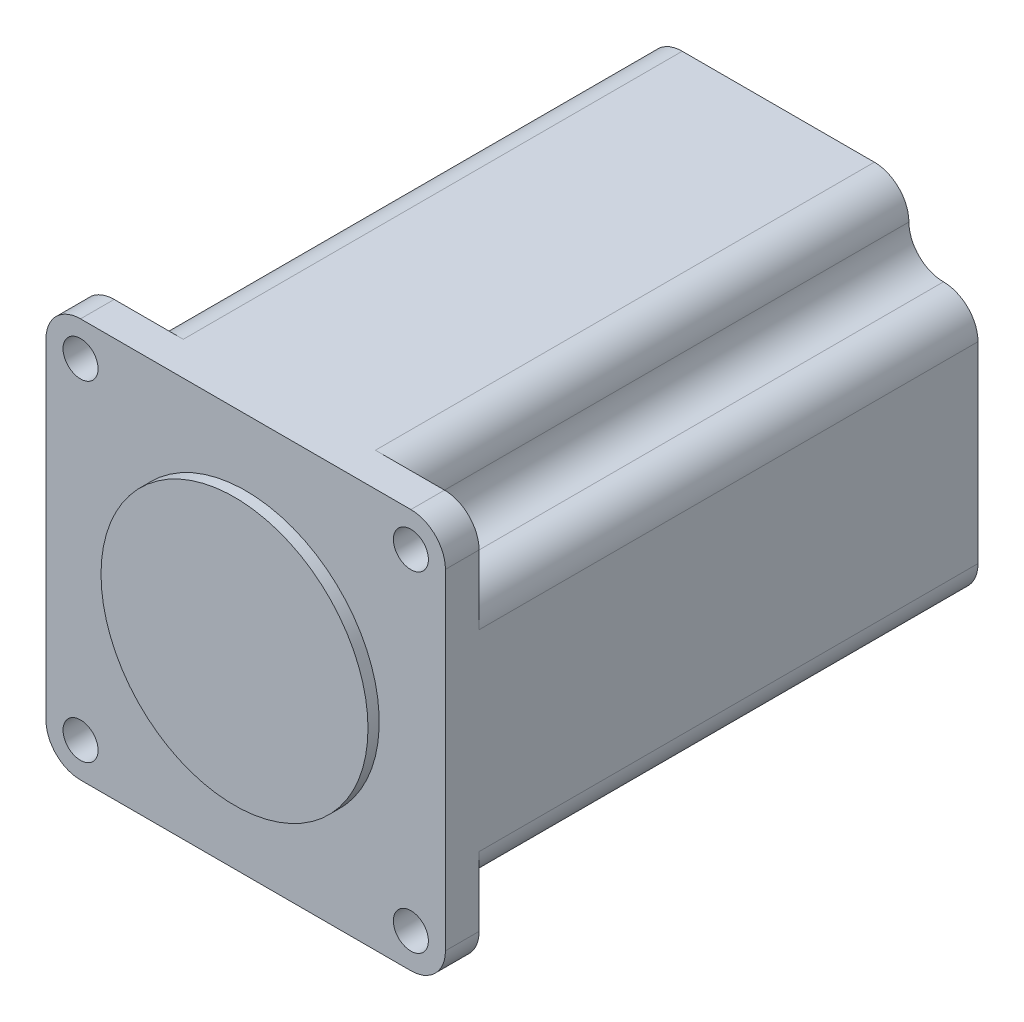
ISO-10303-21;
HEADER;
FILE_DESCRIPTION(('STEP AP214'),'2;1');
FILE_NAME('part.step','',(''),(''),'','','');
FILE_SCHEMA(('AUTOMOTIVE_DESIGN { 1 0 10303 214 1 1 1 1 }'));
ENDSEC;
DATA;
#1=APPLICATION_CONTEXT('core data for automotive mechanical design processes');
#2=APPLICATION_PROTOCOL_DEFINITION('international standard','automotive_design',2000,#1);
#3=PRODUCT_CONTEXT('',#1,'mechanical');
#4=PRODUCT('Part','Part','',(#3));
#5=PRODUCT_RELATED_PRODUCT_CATEGORY('part','',(#4));
#6=PRODUCT_DEFINITION_FORMATION('','',#4);
#7=PRODUCT_DEFINITION_CONTEXT('part definition',#1,'design');
#8=PRODUCT_DEFINITION('design','',#6,#7);
#9=PRODUCT_DEFINITION_SHAPE('','',#8);
#10=(LENGTH_UNIT() NAMED_UNIT(*) SI_UNIT(.MILLI.,.METRE.));
#11=(NAMED_UNIT(*) PLANE_ANGLE_UNIT() SI_UNIT($,.RADIAN.));
#12=(NAMED_UNIT(*) SI_UNIT($,.STERADIAN.) SOLID_ANGLE_UNIT());
#13=UNCERTAINTY_MEASURE_WITH_UNIT(LENGTH_MEASURE(1.E-05),#10,'distance_accuracy_value','');
#14=(GEOMETRIC_REPRESENTATION_CONTEXT(3) GLOBAL_UNCERTAINTY_ASSIGNED_CONTEXT((#13)) GLOBAL_UNIT_ASSIGNED_CONTEXT((#10,
#11,#12)) REPRESENTATION_CONTEXT('',''));
#15=CARTESIAN_POINT('',(0.,0.,0.));
#16=DIRECTION('',(0.,0.,1.));
#17=DIRECTION('',(1.,0.,0.));
#18=AXIS2_PLACEMENT_3D('',#15,#16,#17);
#19=CARTESIAN_POINT('',(0.,0.,0.));
#20=DIRECTION('',(0.,0.,-1.));
#21=DIRECTION('',(-1.,0.,0.));
#22=AXIS2_PLACEMENT_3D('',#19,#20,#21);
#23=PLANE('',#22);
#24=DIRECTION('',(0.,-1.,0.));
#25=VECTOR('',#24,1.);
#26=CARTESIAN_POINT('',(-28.5,-28.5,0.));
#27=LINE('',#26,#25);
#28=CARTESIAN_POINT('',(-28.5,23.57,0.));
#29=VERTEX_POINT('',#28);
#30=CARTESIAN_POINT('',(-28.5,-23.57,0.));
#31=VERTEX_POINT('',#30);
#32=EDGE_CURVE('E240',#29,#31,#27,.T.);
#33=ORIENTED_EDGE('',*,*,#32,.T.);
#34=CARTESIAN_POINT('',(-23.57,-23.57,0.));
#35=DIRECTION('',(0.,0.,1.));
#36=DIRECTION('',(-1.,0.,0.));
#37=AXIS2_PLACEMENT_3D('',#34,#35,#36);
#38=CIRCLE('',#37,4.93);
#39=CARTESIAN_POINT('',(-23.57,-28.5,0.));
#40=VERTEX_POINT('',#39);
#41=EDGE_CURVE('E265',#31,#40,#38,.T.);
#42=ORIENTED_EDGE('',*,*,#41,.T.);
#43=DIRECTION('',(1.,0.,0.));
#44=VECTOR('',#43,1.);
#45=CARTESIAN_POINT('',(-28.5,-28.5,0.));
#46=LINE('',#45,#44);
#47=CARTESIAN_POINT('',(23.57,-28.5,0.));
#48=VERTEX_POINT('',#47);
#49=EDGE_CURVE('E243',#40,#48,#46,.T.);
#50=ORIENTED_EDGE('',*,*,#49,.T.);
#51=CARTESIAN_POINT('',(23.57,-23.57,0.));
#52=DIRECTION('',(0.,0.,1.));
#53=DIRECTION('',(-1.,0.,0.));
#54=AXIS2_PLACEMENT_3D('',#51,#52,#53);
#55=CIRCLE('',#54,4.93);
#56=CARTESIAN_POINT('',(28.5,-23.57,0.));
#57=VERTEX_POINT('',#56);
#58=EDGE_CURVE('E266',#48,#57,#55,.T.);
#59=ORIENTED_EDGE('',*,*,#58,.T.);
#60=DIRECTION('',(0.,1.,0.));
#61=VECTOR('',#60,1.);
#62=CARTESIAN_POINT('',(28.5,-28.5,0.));
#63=LINE('',#62,#61);
#64=CARTESIAN_POINT('',(28.5,23.57,0.));
#65=VERTEX_POINT('',#64);
#66=EDGE_CURVE('E234',#57,#65,#63,.T.);
#67=ORIENTED_EDGE('',*,*,#66,.T.);
#68=CARTESIAN_POINT('',(23.57,23.57,0.));
#69=DIRECTION('',(0.,0.,1.));
#70=DIRECTION('',(-1.,0.,0.));
#71=AXIS2_PLACEMENT_3D('',#68,#69,#70);
#72=CIRCLE('',#71,4.93);
#73=CARTESIAN_POINT('',(23.57,28.5,0.));
#74=VERTEX_POINT('',#73);
#75=EDGE_CURVE('E288',#65,#74,#72,.T.);
#76=ORIENTED_EDGE('',*,*,#75,.T.);
#77=DIRECTION('',(-1.,0.,0.));
#78=VECTOR('',#77,1.);
#79=CARTESIAN_POINT('',(-28.5,28.5,0.));
#80=LINE('',#79,#78);
#81=CARTESIAN_POINT('',(-23.57,28.5,0.));
#82=VERTEX_POINT('',#81);
#83=EDGE_CURVE('E236',#74,#82,#80,.T.);
#84=ORIENTED_EDGE('',*,*,#83,.T.);
#85=CARTESIAN_POINT('',(-23.57,23.57,0.));
#86=DIRECTION('',(0.,0.,1.));
#87=DIRECTION('',(-1.,0.,0.));
#88=AXIS2_PLACEMENT_3D('',#85,#86,#87);
#89=CIRCLE('',#88,4.93);
#90=EDGE_CURVE('E279',#82,#29,#89,.T.);
#91=ORIENTED_EDGE('',*,*,#90,.T.);
#92=EDGE_LOOP('',(#33,#42,#50,#59,#67,#76,#84,#91));
#93=FACE_BOUND('',#92,.T.);
#94=CARTESIAN_POINT('',(23.57,23.57,0.));
#95=DIRECTION('',(0.,0.,-1.));
#96=DIRECTION('',(-1.,0.,0.));
#97=AXIS2_PLACEMENT_3D('',#94,#95,#96);
#98=CIRCLE('',#97,2.5);
#99=CARTESIAN_POINT('',(21.07,23.57,0.));
#100=VERTEX_POINT('',#99);
#101=EDGE_CURVE('E237',#100,#100,#98,.T.);
#102=ORIENTED_EDGE('',*,*,#101,.T.);
#103=EDGE_LOOP('',(#102));
#104=FACE_BOUND('',#103,.T.);
#105=CARTESIAN_POINT('',(23.57,-23.57,0.));
#106=DIRECTION('',(0.,0.,-1.));
#107=DIRECTION('',(-1.,0.,0.));
#108=AXIS2_PLACEMENT_3D('',#105,#106,#107);
#109=CIRCLE('',#108,2.5);
#110=CARTESIAN_POINT('',(21.07,-23.57,0.));
#111=VERTEX_POINT('',#110);
#112=EDGE_CURVE('E304',#111,#111,#109,.T.);
#113=ORIENTED_EDGE('',*,*,#112,.T.);
#114=EDGE_LOOP('',(#113));
#115=FACE_BOUND('',#114,.T.);
#116=CARTESIAN_POINT('',(-23.57,23.57,0.));
#117=DIRECTION('',(0.,0.,-1.));
#118=DIRECTION('',(-1.,0.,0.));
#119=AXIS2_PLACEMENT_3D('',#116,#117,#118);
#120=CIRCLE('',#119,2.5);
#121=CARTESIAN_POINT('',(-26.07,23.57,0.));
#122=VERTEX_POINT('',#121);
#123=EDGE_CURVE('E301',#122,#122,#120,.T.);
#124=ORIENTED_EDGE('',*,*,#123,.T.);
#125=EDGE_LOOP('',(#124));
#126=FACE_BOUND('',#125,.T.);
#127=CARTESIAN_POINT('',(-23.57,-23.57,0.));
#128=DIRECTION('',(0.,0.,-1.));
#129=DIRECTION('',(-1.,0.,0.));
#130=AXIS2_PLACEMENT_3D('',#127,#128,#129);
#131=CIRCLE('',#130,2.5);
#132=CARTESIAN_POINT('',(-26.07,-23.57,0.));
#133=VERTEX_POINT('',#132);
#134=EDGE_CURVE('E296',#133,#133,#131,.T.);
#135=ORIENTED_EDGE('',*,*,#134,.T.);
#136=EDGE_LOOP('',(#135));
#137=FACE_BOUND('',#136,.T.);
#138=CARTESIAN_POINT('',(0.,0.,0.));
#139=DIRECTION('',(0.,0.,-1.));
#140=DIRECTION('',(-1.,0.,0.));
#141=AXIS2_PLACEMENT_3D('',#138,#139,#140);
#142=CIRCLE('',#141,19.05);
#143=CARTESIAN_POINT('',(-19.05,0.,0.));
#144=VERTEX_POINT('',#143);
#145=EDGE_CURVE('E13',#144,#144,#142,.F.);
#146=ORIENTED_EDGE('',*,*,#145,.F.);
#147=EDGE_LOOP('',(#146));
#148=FACE_BOUND('',#147,.T.);
#149=ADVANCED_FACE('F37',(#93,#104,#115,#126,#137,#148),#23,.F.);
#150=CARTESIAN_POINT('',(-28.5,-28.5,-76.));
#151=DIRECTION('',(-1.,0.,0.));
#152=DIRECTION('',(0.,0.,1.));
#153=AXIS2_PLACEMENT_3D('',#150,#151,#152);
#154=PLANE('',#153);
#155=DIRECTION('',(0.,0.,-1.));
#156=VECTOR('',#155,1.);
#157=CARTESIAN_POINT('',(-28.5,23.57,0.));
#158=LINE('',#157,#156);
#159=CARTESIAN_POINT('',(-28.5,23.57,-4.8));
#160=VERTEX_POINT('',#159);
#161=EDGE_CURVE('E284',#29,#160,#158,.T.);
#162=ORIENTED_EDGE('',*,*,#161,.T.);
#163=DIRECTION('',(0.,-1.,0.));
#164=VECTOR('',#163,1.);
#165=CARTESIAN_POINT('',(-28.5,-28.5,-4.8));
#166=LINE('',#165,#164);
#167=CARTESIAN_POINT('',(-28.5,13.71,-4.8));
#168=VERTEX_POINT('',#167);
#169=EDGE_CURVE('E60',#160,#168,#166,.T.);
#170=ORIENTED_EDGE('',*,*,#169,.T.);
#171=DIRECTION('',(0.,0.,-1.));
#172=VECTOR('',#171,1.);
#173=CARTESIAN_POINT('',(-28.5,13.71,85.205945086086));
#174=LINE('',#173,#172);
#175=CARTESIAN_POINT('',(-28.5,13.71,-76.));
#176=VERTEX_POINT('',#175);
#177=EDGE_CURVE('E202',#168,#176,#174,.T.);
#178=ORIENTED_EDGE('',*,*,#177,.T.);
#179=DIRECTION('',(0.,-1.,0.));
#180=VECTOR('',#179,1.);
#181=CARTESIAN_POINT('',(-28.5,-28.5,-76.));
#182=LINE('',#181,#180);
#183=CARTESIAN_POINT('',(-28.5,-13.7099999999999,-76.));
#184=VERTEX_POINT('',#183);
#185=EDGE_CURVE('E217',#176,#184,#182,.T.);
#186=ORIENTED_EDGE('',*,*,#185,.T.);
#187=DIRECTION('',(0.,0.,-1.));
#188=VECTOR('',#187,1.);
#189=CARTESIAN_POINT('',(-28.5,-13.7099999999999,85.205945086086));
#190=LINE('',#189,#188);
#191=CARTESIAN_POINT('',(-28.5,-13.7099999999999,-4.8));
#192=VERTEX_POINT('',#191);
#193=EDGE_CURVE('E218',#192,#184,#190,.T.);
#194=ORIENTED_EDGE('',*,*,#193,.F.);
#195=CARTESIAN_POINT('',(-28.5,-23.57,-4.8));
#196=VERTEX_POINT('',#195);
#197=EDGE_CURVE('E250',#192,#196,#166,.T.);
#198=ORIENTED_EDGE('',*,*,#197,.T.);
#199=DIRECTION('',(0.,0.,-1.));
#200=VECTOR('',#199,1.);
#201=CARTESIAN_POINT('',(-28.5,-23.57,0.));
#202=LINE('',#201,#200);
#203=EDGE_CURVE('E260',#31,#196,#202,.T.);
#204=ORIENTED_EDGE('',*,*,#203,.F.);
#205=ORIENTED_EDGE('',*,*,#32,.F.);
#206=EDGE_LOOP('',(#162,#170,#178,#186,#194,#198,#204,#205));
#207=FACE_BOUND('',#206,.T.);
#208=ADVANCED_FACE('F215',(#207),#154,.T.);
#209=CARTESIAN_POINT('',(-28.5,-28.5,-76.));
#210=DIRECTION('',(0.,-1.,0.));
#211=DIRECTION('',(0.,0.,-1.));
#212=AXIS2_PLACEMENT_3D('',#209,#210,#211);
#213=PLANE('',#212);
#214=DIRECTION('',(0.,0.,-1.));
#215=VECTOR('',#214,1.);
#216=CARTESIAN_POINT('',(-23.57,-28.5,0.));
#217=LINE('',#216,#215);
#218=CARTESIAN_POINT('',(-23.57,-28.5,-4.8));
#219=VERTEX_POINT('',#218);
#220=EDGE_CURVE('E267',#40,#219,#217,.T.);
#221=ORIENTED_EDGE('',*,*,#220,.T.);
#222=DIRECTION('',(1.,0.,0.));
#223=VECTOR('',#222,1.);
#224=CARTESIAN_POINT('',(-28.5,-28.5,-4.8));
#225=LINE('',#224,#223);
#226=CARTESIAN_POINT('',(-13.71,-28.5,-4.8));
#227=VERTEX_POINT('',#226);
#228=EDGE_CURVE('E254',#219,#227,#225,.T.);
#229=ORIENTED_EDGE('',*,*,#228,.T.);
#230=DIRECTION('',(0.,0.,-1.));
#231=VECTOR('',#230,1.);
#232=CARTESIAN_POINT('',(-13.71,-28.5,85.205945086086));
#233=LINE('',#232,#231);
#234=CARTESIAN_POINT('',(-13.71,-28.5,-76.));
#235=VERTEX_POINT('',#234);
#236=EDGE_CURVE('E350',#227,#235,#233,.T.);
#237=ORIENTED_EDGE('',*,*,#236,.T.);
#238=DIRECTION('',(1.,0.,0.));
#239=VECTOR('',#238,1.);
#240=CARTESIAN_POINT('',(-28.5,-28.5,-76.));
#241=LINE('',#240,#239);
#242=CARTESIAN_POINT('',(13.71,-28.5,-76.));
#243=VERTEX_POINT('',#242);
#244=EDGE_CURVE('E224',#235,#243,#241,.T.);
#245=ORIENTED_EDGE('',*,*,#244,.T.);
#246=DIRECTION('',(0.,0.,-1.));
#247=VECTOR('',#246,1.);
#248=CARTESIAN_POINT('',(13.71,-28.5,85.205945086086));
#249=LINE('',#248,#247);
#250=CARTESIAN_POINT('',(13.71,-28.5,-4.8));
#251=VERTEX_POINT('',#250);
#252=EDGE_CURVE('E353',#251,#243,#249,.T.);
#253=ORIENTED_EDGE('',*,*,#252,.F.);
#254=CARTESIAN_POINT('',(23.57,-28.5,-4.8));
#255=VERTEX_POINT('',#254);
#256=EDGE_CURVE('E375',#251,#255,#225,.T.);
#257=ORIENTED_EDGE('',*,*,#256,.T.);
#258=DIRECTION('',(0.,0.,-1.));
#259=VECTOR('',#258,1.);
#260=CARTESIAN_POINT('',(23.57,-28.5,0.));
#261=LINE('',#260,#259);
#262=EDGE_CURVE('E276',#48,#255,#261,.T.);
#263=ORIENTED_EDGE('',*,*,#262,.F.);
#264=ORIENTED_EDGE('',*,*,#49,.F.);
#265=EDGE_LOOP('',(#221,#229,#237,#245,#253,#257,#263,#264));
#266=FACE_BOUND('',#265,.T.);
#267=ADVANCED_FACE('F406',(#266),#213,.T.);
#268=CARTESIAN_POINT('',(-28.5,28.5,-76.));
#269=DIRECTION('',(0.,1.,0.));
#270=DIRECTION('',(0.,0.,1.));
#271=AXIS2_PLACEMENT_3D('',#268,#269,#270);
#272=PLANE('',#271);
#273=DIRECTION('',(0.,0.,-1.));
#274=VECTOR('',#273,1.);
#275=CARTESIAN_POINT('',(23.57,28.5,0.));
#276=LINE('',#275,#274);
#277=CARTESIAN_POINT('',(23.57,28.5,-4.8));
#278=VERTEX_POINT('',#277);
#279=EDGE_CURVE('E292',#74,#278,#276,.T.);
#280=ORIENTED_EDGE('',*,*,#279,.T.);
#281=DIRECTION('',(-1.,0.,0.));
#282=VECTOR('',#281,1.);
#283=CARTESIAN_POINT('',(-28.5,28.5,-4.8));
#284=LINE('',#283,#282);
#285=CARTESIAN_POINT('',(13.71,28.5,-4.8));
#286=VERTEX_POINT('',#285);
#287=EDGE_CURVE('E52',#278,#286,#284,.T.);
#288=ORIENTED_EDGE('',*,*,#287,.T.);
#289=DIRECTION('',(0.,0.,-1.));
#290=VECTOR('',#289,1.);
#291=CARTESIAN_POINT('',(13.71,28.5,85.205945086086));
#292=LINE('',#291,#290);
#293=CARTESIAN_POINT('',(13.71,28.5,-76.));
#294=VERTEX_POINT('',#293);
#295=EDGE_CURVE('E365',#286,#294,#292,.T.);
#296=ORIENTED_EDGE('',*,*,#295,.T.);
#297=DIRECTION('',(-1.,0.,0.));
#298=VECTOR('',#297,1.);
#299=CARTESIAN_POINT('',(-28.5,28.5,-76.));
#300=LINE('',#299,#298);
#301=CARTESIAN_POINT('',(-13.71,28.5,-76.));
#302=VERTEX_POINT('',#301);
#303=EDGE_CURVE('E225',#294,#302,#300,.T.);
#304=ORIENTED_EDGE('',*,*,#303,.T.);
#305=DIRECTION('',(0.,0.,-1.));
#306=VECTOR('',#305,1.);
#307=CARTESIAN_POINT('',(-13.71,28.5,85.205945086086));
#308=LINE('',#307,#306);
#309=CARTESIAN_POINT('',(-13.71,28.5,-4.8));
#310=VERTEX_POINT('',#309);
#311=EDGE_CURVE('E368',#310,#302,#308,.T.);
#312=ORIENTED_EDGE('',*,*,#311,.F.);
#313=CARTESIAN_POINT('',(-23.57,28.5,-4.8));
#314=VERTEX_POINT('',#313);
#315=EDGE_CURVE('E383',#310,#314,#284,.T.);
#316=ORIENTED_EDGE('',*,*,#315,.T.);
#317=DIRECTION('',(0.,0.,-1.));
#318=VECTOR('',#317,1.);
#319=CARTESIAN_POINT('',(-23.57,28.5,0.));
#320=LINE('',#319,#318);
#321=EDGE_CURVE('E285',#82,#314,#320,.T.);
#322=ORIENTED_EDGE('',*,*,#321,.F.);
#323=ORIENTED_EDGE('',*,*,#83,.F.);
#324=EDGE_LOOP('',(#280,#288,#296,#304,#312,#316,#322,#323));
#325=FACE_BOUND('',#324,.T.);
#326=ADVANCED_FACE('F420',(#325),#272,.T.);
#327=CARTESIAN_POINT('',(28.5,-28.5,-76.));
#328=DIRECTION('',(1.,0.,0.));
#329=DIRECTION('',(0.,0.,-1.));
#330=AXIS2_PLACEMENT_3D('',#327,#328,#329);
#331=PLANE('',#330);
#332=DIRECTION('',(0.,0.,-1.));
#333=VECTOR('',#332,1.);
#334=CARTESIAN_POINT('',(28.5,-23.57,0.));
#335=LINE('',#334,#333);
#336=CARTESIAN_POINT('',(28.5,-23.57,-4.8));
#337=VERTEX_POINT('',#336);
#338=EDGE_CURVE('E270',#57,#337,#335,.T.);
#339=ORIENTED_EDGE('',*,*,#338,.T.);
#340=DIRECTION('',(0.,1.,0.));
#341=VECTOR('',#340,1.);
#342=CARTESIAN_POINT('',(28.5,-28.5,-4.8));
#343=LINE('',#342,#341);
#344=CARTESIAN_POINT('',(28.5,-13.71,-4.8));
#345=VERTEX_POINT('',#344);
#346=EDGE_CURVE('E378',#337,#345,#343,.T.);
#347=ORIENTED_EDGE('',*,*,#346,.T.);
#348=DIRECTION('',(0.,0.,-1.));
#349=VECTOR('',#348,1.);
#350=CARTESIAN_POINT('',(28.5,-13.71,85.205945086086));
#351=LINE('',#350,#349);
#352=CARTESIAN_POINT('',(28.5,-13.71,-76.));
#353=VERTEX_POINT('',#352);
#354=EDGE_CURVE('E316',#345,#353,#351,.T.);
#355=ORIENTED_EDGE('',*,*,#354,.T.);
#356=DIRECTION('',(0.,1.,0.));
#357=VECTOR('',#356,1.);
#358=CARTESIAN_POINT('',(28.5,-28.5,-76.));
#359=LINE('',#358,#357);
#360=CARTESIAN_POINT('',(28.5,13.71,-76.));
#361=VERTEX_POINT('',#360);
#362=EDGE_CURVE('E230',#353,#361,#359,.T.);
#363=ORIENTED_EDGE('',*,*,#362,.T.);
#364=DIRECTION('',(0.,0.,-1.));
#365=VECTOR('',#364,1.);
#366=CARTESIAN_POINT('',(28.5,13.71,85.205945086086));
#367=LINE('',#366,#365);
#368=CARTESIAN_POINT('',(28.5,13.71,-4.8));
#369=VERTEX_POINT('',#368);
#370=EDGE_CURVE('E314',#369,#361,#367,.T.);
#371=ORIENTED_EDGE('',*,*,#370,.F.);
#372=CARTESIAN_POINT('',(28.5,23.57,-4.8));
#373=VERTEX_POINT('',#372);
#374=EDGE_CURVE('E380',#369,#373,#343,.T.);
#375=ORIENTED_EDGE('',*,*,#374,.T.);
#376=DIRECTION('',(0.,0.,-1.));
#377=VECTOR('',#376,1.);
#378=CARTESIAN_POINT('',(28.5,23.57,0.));
#379=LINE('',#378,#377);
#380=EDGE_CURVE('E293',#65,#373,#379,.T.);
#381=ORIENTED_EDGE('',*,*,#380,.F.);
#382=ORIENTED_EDGE('',*,*,#66,.F.);
#383=EDGE_LOOP('',(#339,#347,#355,#363,#371,#375,#381,#382));
#384=FACE_BOUND('',#383,.T.);
#385=ADVANCED_FACE('F39',(#384),#331,.T.);
#386=CARTESIAN_POINT('',(0.,0.,-76.));
#387=DIRECTION('',(0.,0.,-1.));
#388=DIRECTION('',(-1.,0.,0.));
#389=AXIS2_PLACEMENT_3D('',#386,#387,#388);
#390=PLANE('',#389);
#391=ORIENTED_EDGE('',*,*,#185,.F.);
#392=CARTESIAN_POINT('',(-23.57,13.71,-76.));
#393=DIRECTION('',(0.,0.,-1.));
#394=DIRECTION('',(1.,0.,0.));
#395=AXIS2_PLACEMENT_3D('',#392,#393,#394);
#396=CIRCLE('',#395,4.93);
#397=CARTESIAN_POINT('',(-23.57,18.64,-76.));
#398=VERTEX_POINT('',#397);
#399=EDGE_CURVE('E199',#176,#398,#396,.T.);
#400=ORIENTED_EDGE('',*,*,#399,.T.);
#401=CARTESIAN_POINT('',(-23.57,23.57,-76.));
#402=DIRECTION('',(0.,0.,1.));
#403=DIRECTION('',(-1.,0.,0.));
#404=AXIS2_PLACEMENT_3D('',#401,#402,#403);
#405=CIRCLE('',#404,4.93);
#406=CARTESIAN_POINT('',(-18.64,23.57,-76.));
#407=VERTEX_POINT('',#406);
#408=EDGE_CURVE('E209',#398,#407,#405,.T.);
#409=ORIENTED_EDGE('',*,*,#408,.T.);
#410=CARTESIAN_POINT('',(-13.71,23.57,-76.));
#411=DIRECTION('',(0.,0.,-1.));
#412=DIRECTION('',(-1.,0.,0.));
#413=AXIS2_PLACEMENT_3D('',#410,#411,#412);
#414=CIRCLE('',#413,4.93000000000002);
#415=EDGE_CURVE('E439',#407,#302,#414,.T.);
#416=ORIENTED_EDGE('',*,*,#415,.T.);
#417=ORIENTED_EDGE('',*,*,#303,.F.);
#418=CARTESIAN_POINT('',(13.71,23.57,-76.));
#419=DIRECTION('',(0.,0.,-1.));
#420=DIRECTION('',(1.,0.,0.));
#421=AXIS2_PLACEMENT_3D('',#418,#419,#420);
#422=CIRCLE('',#421,4.93);
#423=CARTESIAN_POINT('',(18.64,23.57,-76.));
#424=VERTEX_POINT('',#423);
#425=EDGE_CURVE('E332',#294,#424,#422,.T.);
#426=ORIENTED_EDGE('',*,*,#425,.T.);
#427=CARTESIAN_POINT('',(23.57,23.57,-76.));
#428=DIRECTION('',(0.,0.,1.));
#429=DIRECTION('',(-1.,0.,0.));
#430=AXIS2_PLACEMENT_3D('',#427,#428,#429);
#431=CIRCLE('',#430,4.93);
#432=CARTESIAN_POINT('',(23.57,18.64,-76.));
#433=VERTEX_POINT('',#432);
#434=EDGE_CURVE('E326',#424,#433,#431,.T.);
#435=ORIENTED_EDGE('',*,*,#434,.T.);
#436=CARTESIAN_POINT('',(23.57,13.71,-76.));
#437=DIRECTION('',(0.,0.,-1.));
#438=DIRECTION('',(-1.,0.,0.));
#439=AXIS2_PLACEMENT_3D('',#436,#437,#438);
#440=CIRCLE('',#439,4.93);
#441=EDGE_CURVE('E323',#433,#361,#440,.T.);
#442=ORIENTED_EDGE('',*,*,#441,.T.);
#443=ORIENTED_EDGE('',*,*,#362,.F.);
#444=CARTESIAN_POINT('',(23.57,-13.71,-76.));
#445=DIRECTION('',(0.,0.,-1.));
#446=DIRECTION('',(1.,0.,0.));
#447=AXIS2_PLACEMENT_3D('',#444,#445,#446);
#448=CIRCLE('',#447,4.93);
#449=CARTESIAN_POINT('',(23.57,-18.64,-76.));
#450=VERTEX_POINT('',#449);
#451=EDGE_CURVE('E320',#353,#450,#448,.T.);
#452=ORIENTED_EDGE('',*,*,#451,.T.);
#453=CARTESIAN_POINT('',(23.57,-23.57,-76.));
#454=DIRECTION('',(0.,0.,1.));
#455=DIRECTION('',(-1.,0.,0.));
#456=AXIS2_PLACEMENT_3D('',#453,#454,#455);
#457=CIRCLE('',#456,4.93);
#458=CARTESIAN_POINT('',(18.64,-23.57,-76.));
#459=VERTEX_POINT('',#458);
#460=EDGE_CURVE('E330',#450,#459,#457,.T.);
#461=ORIENTED_EDGE('',*,*,#460,.T.);
#462=CARTESIAN_POINT('',(13.71,-23.57,-76.));
#463=DIRECTION('',(0.,0.,-1.));
#464=DIRECTION('',(-1.,0.,0.));
#465=AXIS2_PLACEMENT_3D('',#462,#463,#464);
#466=CIRCLE('',#465,4.93000000000002);
#467=EDGE_CURVE('E337',#459,#243,#466,.T.);
#468=ORIENTED_EDGE('',*,*,#467,.T.);
#469=ORIENTED_EDGE('',*,*,#244,.F.);
#470=CARTESIAN_POINT('',(-13.71,-23.57,-76.));
#471=DIRECTION('',(0.,0.,-1.));
#472=DIRECTION('',(1.,0.,0.));
#473=AXIS2_PLACEMENT_3D('',#470,#471,#472);
#474=CIRCLE('',#473,4.93);
#475=CARTESIAN_POINT('',(-18.64,-23.57,-76.));
#476=VERTEX_POINT('',#475);
#477=EDGE_CURVE('E340',#235,#476,#474,.T.);
#478=ORIENTED_EDGE('',*,*,#477,.T.);
#479=CARTESIAN_POINT('',(-23.57,-23.57,-76.));
#480=DIRECTION('',(0.,0.,1.));
#481=DIRECTION('',(-1.,0.,0.));
#482=AXIS2_PLACEMENT_3D('',#479,#480,#481);
#483=CIRCLE('',#482,4.93000000000004);
#484=CARTESIAN_POINT('',(-23.57,-18.64,-76.));
#485=VERTEX_POINT('',#484);
#486=EDGE_CURVE('E343',#476,#485,#483,.T.);
#487=ORIENTED_EDGE('',*,*,#486,.T.);
#488=CARTESIAN_POINT('',(-23.57,-13.7099999999999,-76.));
#489=DIRECTION('',(0.,0.,-1.));
#490=DIRECTION('',(-1.,0.,0.));
#491=AXIS2_PLACEMENT_3D('',#488,#489,#490);
#492=CIRCLE('',#491,4.93000000000002);
#493=EDGE_CURVE('E210',#485,#184,#492,.T.);
#494=ORIENTED_EDGE('',*,*,#493,.T.);
#495=EDGE_LOOP('',(#391,#400,#409,#416,#417,#426,#435,#442,#443,#452,#461,#468,#469,#478,#487,#494));
#496=FACE_BOUND('',#495,.T.);
#497=ADVANCED_FACE('F221',(#496),#390,.T.);
#498=CARTESIAN_POINT('',(23.57,23.57,0.));
#499=DIRECTION('',(0.,0.,-1.));
#500=DIRECTION('',(-1.,0.,0.));
#501=AXIS2_PLACEMENT_3D('',#498,#499,#500);
#502=CYLINDRICAL_SURFACE('',#501,2.5);
#503=ORIENTED_EDGE('',*,*,#101,.F.);
#504=EDGE_LOOP('',(#503));
#505=FACE_BOUND('',#504,.T.);
#506=CARTESIAN_POINT('',(23.57,23.57,-4.8));
#507=DIRECTION('',(0.,0.,-1.));
#508=DIRECTION('',(-1.,0.,0.));
#509=AXIS2_PLACEMENT_3D('',#506,#507,#508);
#510=CIRCLE('',#509,2.5);
#511=CARTESIAN_POINT('',(21.07,23.57,-4.8));
#512=VERTEX_POINT('',#511);
#513=EDGE_CURVE('E396',#512,#512,#510,.F.);
#514=ORIENTED_EDGE('',*,*,#513,.F.);
#515=EDGE_LOOP('',(#514));
#516=FACE_BOUND('',#515,.T.);
#517=ADVANCED_FACE('F498',(#505,#516),#502,.F.);
#518=CARTESIAN_POINT('',(23.57,-23.57,0.));
#519=DIRECTION('',(0.,0.,-1.));
#520=DIRECTION('',(-1.,0.,0.));
#521=AXIS2_PLACEMENT_3D('',#518,#519,#520);
#522=CYLINDRICAL_SURFACE('',#521,2.5);
#523=ORIENTED_EDGE('',*,*,#112,.F.);
#524=EDGE_LOOP('',(#523));
#525=FACE_BOUND('',#524,.T.);
#526=CARTESIAN_POINT('',(23.57,-23.57,-4.8));
#527=DIRECTION('',(0.,0.,-1.));
#528=DIRECTION('',(-1.,0.,0.));
#529=AXIS2_PLACEMENT_3D('',#526,#527,#528);
#530=CIRCLE('',#529,2.5);
#531=CARTESIAN_POINT('',(21.07,-23.57,-4.8));
#532=VERTEX_POINT('',#531);
#533=EDGE_CURVE('E394',#532,#532,#530,.F.);
#534=ORIENTED_EDGE('',*,*,#533,.F.);
#535=EDGE_LOOP('',(#534));
#536=FACE_BOUND('',#535,.T.);
#537=ADVANCED_FACE('F502',(#525,#536),#522,.F.);
#538=CARTESIAN_POINT('',(-23.57,23.57,0.));
#539=DIRECTION('',(0.,0.,-1.));
#540=DIRECTION('',(-1.,0.,0.));
#541=AXIS2_PLACEMENT_3D('',#538,#539,#540);
#542=CYLINDRICAL_SURFACE('',#541,2.5);
#543=ORIENTED_EDGE('',*,*,#123,.F.);
#544=EDGE_LOOP('',(#543));
#545=FACE_BOUND('',#544,.T.);
#546=CARTESIAN_POINT('',(-23.57,23.57,-4.8));
#547=DIRECTION('',(0.,0.,-1.));
#548=DIRECTION('',(-1.,0.,0.));
#549=AXIS2_PLACEMENT_3D('',#546,#547,#548);
#550=CIRCLE('',#549,2.5);
#551=CARTESIAN_POINT('',(-26.07,23.57,-4.8));
#552=VERTEX_POINT('',#551);
#553=EDGE_CURVE('E391',#552,#552,#550,.F.);
#554=ORIENTED_EDGE('',*,*,#553,.F.);
#555=EDGE_LOOP('',(#554));
#556=FACE_BOUND('',#555,.T.);
#557=ADVANCED_FACE('F507',(#545,#556),#542,.F.);
#558=CARTESIAN_POINT('',(-23.57,-23.57,0.));
#559=DIRECTION('',(0.,0.,-1.));
#560=DIRECTION('',(-1.,0.,0.));
#561=AXIS2_PLACEMENT_3D('',#558,#559,#560);
#562=CYLINDRICAL_SURFACE('',#561,2.5);
#563=ORIENTED_EDGE('',*,*,#134,.F.);
#564=EDGE_LOOP('',(#563));
#565=FACE_BOUND('',#564,.T.);
#566=CARTESIAN_POINT('',(-23.57,-23.57,-4.8));
#567=DIRECTION('',(0.,0.,-1.));
#568=DIRECTION('',(-1.,0.,0.));
#569=AXIS2_PLACEMENT_3D('',#566,#567,#568);
#570=CIRCLE('',#569,2.5);
#571=CARTESIAN_POINT('',(-26.07,-23.57,-4.8));
#572=VERTEX_POINT('',#571);
#573=EDGE_CURVE('E388',#572,#572,#570,.F.);
#574=ORIENTED_EDGE('',*,*,#573,.F.);
#575=EDGE_LOOP('',(#574));
#576=FACE_BOUND('',#575,.T.);
#577=ADVANCED_FACE('F515',(#565,#576),#562,.F.);
#578=CARTESIAN_POINT('',(23.57,23.57,0.));
#579=DIRECTION('',(0.,0.,-1.));
#580=DIRECTION('',(-1.,0.,0.));
#581=AXIS2_PLACEMENT_3D('',#578,#579,#580);
#582=CYLINDRICAL_SURFACE('',#581,4.93);
#583=CARTESIAN_POINT('',(23.57,23.57,-4.8));
#584=DIRECTION('',(0.,0.,-1.));
#585=DIRECTION('',(-1.,0.,0.));
#586=AXIS2_PLACEMENT_3D('',#583,#584,#585);
#587=CIRCLE('',#586,4.93);
#588=EDGE_CURVE('E386',#278,#373,#587,.T.);
#589=ORIENTED_EDGE('',*,*,#588,.F.);
#590=ORIENTED_EDGE('',*,*,#279,.F.);
#591=ORIENTED_EDGE('',*,*,#75,.F.);
#592=ORIENTED_EDGE('',*,*,#380,.T.);
#593=EDGE_LOOP('',(#589,#590,#591,#592));
#594=FACE_BOUND('',#593,.T.);
#595=ADVANCED_FACE('F416',(#594),#582,.T.);
#596=CARTESIAN_POINT('',(-23.57,23.57,0.));
#597=DIRECTION('',(0.,0.,-1.));
#598=DIRECTION('',(-1.,0.,0.));
#599=AXIS2_PLACEMENT_3D('',#596,#597,#598);
#600=CYLINDRICAL_SURFACE('',#599,4.93);
#601=CARTESIAN_POINT('',(-23.57,23.57,-4.8));
#602=DIRECTION('',(0.,0.,-1.));
#603=DIRECTION('',(-1.,0.,0.));
#604=AXIS2_PLACEMENT_3D('',#601,#602,#603);
#605=CIRCLE('',#604,4.93);
#606=EDGE_CURVE('E381',#160,#314,#605,.T.);
#607=ORIENTED_EDGE('',*,*,#606,.F.);
#608=ORIENTED_EDGE('',*,*,#161,.F.);
#609=ORIENTED_EDGE('',*,*,#90,.F.);
#610=ORIENTED_EDGE('',*,*,#321,.T.);
#611=EDGE_LOOP('',(#607,#608,#609,#610));
#612=FACE_BOUND('',#611,.T.);
#613=ADVANCED_FACE('F423',(#612),#600,.T.);
#614=CARTESIAN_POINT('',(23.57,-23.57,0.));
#615=DIRECTION('',(0.,0.,-1.));
#616=DIRECTION('',(-1.,0.,0.));
#617=AXIS2_PLACEMENT_3D('',#614,#615,#616);
#618=CYLINDRICAL_SURFACE('',#617,4.93);
#619=CARTESIAN_POINT('',(23.57,-23.57,-4.8));
#620=DIRECTION('',(0.,0.,-1.));
#621=DIRECTION('',(-1.,0.,0.));
#622=AXIS2_PLACEMENT_3D('',#619,#620,#621);
#623=CIRCLE('',#622,4.93);
#624=EDGE_CURVE('E261',#337,#255,#623,.T.);
#625=ORIENTED_EDGE('',*,*,#624,.F.);
#626=ORIENTED_EDGE('',*,*,#338,.F.);
#627=ORIENTED_EDGE('',*,*,#58,.F.);
#628=ORIENTED_EDGE('',*,*,#262,.T.);
#629=EDGE_LOOP('',(#625,#626,#627,#628));
#630=FACE_BOUND('',#629,.T.);
#631=ADVANCED_FACE('F411',(#630),#618,.T.);
#632=CARTESIAN_POINT('',(-23.57,-23.57,0.));
#633=DIRECTION('',(0.,0.,-1.));
#634=DIRECTION('',(-1.,0.,0.));
#635=AXIS2_PLACEMENT_3D('',#632,#633,#634);
#636=CYLINDRICAL_SURFACE('',#635,4.93);
#637=CARTESIAN_POINT('',(-23.57,-23.57,-4.8));
#638=DIRECTION('',(0.,0.,-1.));
#639=DIRECTION('',(-1.,0.,0.));
#640=AXIS2_PLACEMENT_3D('',#637,#638,#639);
#641=CIRCLE('',#640,4.93);
#642=EDGE_CURVE('E45',#219,#196,#641,.T.);
#643=ORIENTED_EDGE('',*,*,#642,.F.);
#644=ORIENTED_EDGE('',*,*,#220,.F.);
#645=ORIENTED_EDGE('',*,*,#41,.F.);
#646=ORIENTED_EDGE('',*,*,#203,.T.);
#647=EDGE_LOOP('',(#643,#644,#645,#646));
#648=FACE_BOUND('',#647,.T.);
#649=ADVANCED_FACE('F263',(#648),#636,.T.);
#650=CARTESIAN_POINT('',(0.,0.,-4.8));
#651=DIRECTION('',(0.,0.,-1.));
#652=DIRECTION('',(-1.,0.,0.));
#653=AXIS2_PLACEMENT_3D('',#650,#651,#652);
#654=PLANE('',#653);
#655=CARTESIAN_POINT('',(-23.57,-13.7099999999999,-4.8));
#656=DIRECTION('',(0.,0.,-1.));
#657=DIRECTION('',(-1.,0.,0.));
#658=AXIS2_PLACEMENT_3D('',#655,#656,#657);
#659=CIRCLE('',#658,4.93000000000002);
#660=CARTESIAN_POINT('',(-23.57,-18.64,-4.8));
#661=VERTEX_POINT('',#660);
#662=EDGE_CURVE('E347',#192,#661,#659,.F.);
#663=ORIENTED_EDGE('',*,*,#662,.T.);
#664=CARTESIAN_POINT('',(-23.57,-23.57,-4.8));
#665=DIRECTION('',(0.,0.,-1.));
#666=DIRECTION('',(-1.,0.,0.));
#667=AXIS2_PLACEMENT_3D('',#664,#665,#666);
#668=CIRCLE('',#667,4.93000000000004);
#669=CARTESIAN_POINT('',(-18.64,-23.57,-4.8));
#670=VERTEX_POINT('',#669);
#671=EDGE_CURVE('E446',#661,#670,#668,.T.);
#672=ORIENTED_EDGE('',*,*,#671,.T.);
#673=CARTESIAN_POINT('',(-13.71,-23.57,-4.8));
#674=DIRECTION('',(0.,0.,-1.));
#675=DIRECTION('',(-1.,0.,0.));
#676=AXIS2_PLACEMENT_3D('',#673,#674,#675);
#677=CIRCLE('',#676,4.93);
#678=EDGE_CURVE('E449',#670,#227,#677,.F.);
#679=ORIENTED_EDGE('',*,*,#678,.T.);
#680=ORIENTED_EDGE('',*,*,#228,.F.);
#681=ORIENTED_EDGE('',*,*,#642,.T.);
#682=ORIENTED_EDGE('',*,*,#197,.F.);
#683=EDGE_LOOP('',(#663,#672,#679,#680,#681,#682));
#684=FACE_BOUND('',#683,.T.);
#685=ORIENTED_EDGE('',*,*,#573,.T.);
#686=EDGE_LOOP('',(#685));
#687=FACE_BOUND('',#686,.T.);
#688=ADVANCED_FACE('F248',(#684,#687),#654,.T.);
#689=CARTESIAN_POINT('',(-23.57,-13.7099999999999,85.205945086086));
#690=DIRECTION('',(0.,0.,-1.));
#691=DIRECTION('',(-1.,0.,0.));
#692=AXIS2_PLACEMENT_3D('',#689,#690,#691);
#693=CYLINDRICAL_SURFACE('',#692,4.93000000000002);
#694=ORIENTED_EDGE('',*,*,#193,.T.);
#695=ORIENTED_EDGE('',*,*,#493,.F.);
#696=DIRECTION('',(0.,0.,-1.));
#697=VECTOR('',#696,1.);
#698=CARTESIAN_POINT('',(-23.57,-18.64,85.205945086086));
#699=LINE('',#698,#697);
#700=EDGE_CURVE('E345',#661,#485,#699,.T.);
#701=ORIENTED_EDGE('',*,*,#700,.F.);
#702=ORIENTED_EDGE('',*,*,#662,.F.);
#703=EDGE_LOOP('',(#694,#695,#701,#702));
#704=FACE_BOUND('',#703,.T.);
#705=ADVANCED_FACE('F528',(#704),#693,.T.);
#706=CARTESIAN_POINT('',(-23.57,-23.57,85.205945086086));
#707=DIRECTION('',(0.,0.,-1.));
#708=DIRECTION('',(-1.,0.,0.));
#709=AXIS2_PLACEMENT_3D('',#706,#707,#708);
#710=CYLINDRICAL_SURFACE('',#709,4.93000000000004);
#711=ORIENTED_EDGE('',*,*,#700,.T.);
#712=ORIENTED_EDGE('',*,*,#486,.F.);
#713=DIRECTION('',(0.,0.,-1.));
#714=VECTOR('',#713,1.);
#715=CARTESIAN_POINT('',(-18.64,-23.57,85.205945086086));
#716=LINE('',#715,#714);
#717=EDGE_CURVE('E348',#670,#476,#716,.T.);
#718=ORIENTED_EDGE('',*,*,#717,.F.);
#719=ORIENTED_EDGE('',*,*,#671,.F.);
#720=EDGE_LOOP('',(#711,#712,#718,#719));
#721=FACE_BOUND('',#720,.T.);
#722=ADVANCED_FACE('F531',(#721),#710,.F.);
#723=CARTESIAN_POINT('',(-13.71,-23.57,85.205945086086));
#724=DIRECTION('',(0.,0.,-1.));
#725=DIRECTION('',(-1.,0.,0.));
#726=AXIS2_PLACEMENT_3D('',#723,#724,#725);
#727=CYLINDRICAL_SURFACE('',#726,4.93);
#728=ORIENTED_EDGE('',*,*,#717,.T.);
#729=ORIENTED_EDGE('',*,*,#477,.F.);
#730=ORIENTED_EDGE('',*,*,#236,.F.);
#731=ORIENTED_EDGE('',*,*,#678,.F.);
#732=EDGE_LOOP('',(#728,#729,#730,#731));
#733=FACE_BOUND('',#732,.T.);
#734=ADVANCED_FACE('F565',(#733),#727,.T.);
#735=CARTESIAN_POINT('',(13.71,-23.57,-4.8));
#736=DIRECTION('',(0.,0.,-1.));
#737=DIRECTION('',(-1.,0.,0.));
#738=AXIS2_PLACEMENT_3D('',#735,#736,#737);
#739=CIRCLE('',#738,4.93000000000002);
#740=CARTESIAN_POINT('',(18.64,-23.57,-4.8));
#741=VERTEX_POINT('',#740);
#742=EDGE_CURVE('E451',#251,#741,#739,.F.);
#743=ORIENTED_EDGE('',*,*,#742,.T.);
#744=CARTESIAN_POINT('',(23.57,-23.57,-4.8));
#745=DIRECTION('',(0.,0.,-1.));
#746=DIRECTION('',(-1.,0.,0.));
#747=AXIS2_PLACEMENT_3D('',#744,#745,#746);
#748=CIRCLE('',#747,4.93);
#749=CARTESIAN_POINT('',(23.57,-18.64,-4.8));
#750=VERTEX_POINT('',#749);
#751=EDGE_CURVE('E454',#741,#750,#748,.T.);
#752=ORIENTED_EDGE('',*,*,#751,.T.);
#753=CARTESIAN_POINT('',(23.57,-13.71,-4.8));
#754=DIRECTION('',(0.,0.,-1.));
#755=DIRECTION('',(-1.,0.,0.));
#756=AXIS2_PLACEMENT_3D('',#753,#754,#755);
#757=CIRCLE('',#756,4.93);
#758=EDGE_CURVE('E457',#750,#345,#757,.F.);
#759=ORIENTED_EDGE('',*,*,#758,.T.);
#760=ORIENTED_EDGE('',*,*,#346,.F.);
#761=ORIENTED_EDGE('',*,*,#624,.T.);
#762=ORIENTED_EDGE('',*,*,#256,.F.);
#763=EDGE_LOOP('',(#743,#752,#759,#760,#761,#762));
#764=FACE_BOUND('',#763,.T.);
#765=ORIENTED_EDGE('',*,*,#533,.T.);
#766=EDGE_LOOP('',(#765));
#767=FACE_BOUND('',#766,.T.);
#768=ADVANCED_FACE('F563',(#764,#767),#654,.T.);
#769=CARTESIAN_POINT('',(13.71,-23.57,85.205945086086));
#770=DIRECTION('',(0.,0.,-1.));
#771=DIRECTION('',(-1.,0.,0.));
#772=AXIS2_PLACEMENT_3D('',#769,#770,#771);
#773=CYLINDRICAL_SURFACE('',#772,4.93000000000002);
#774=ORIENTED_EDGE('',*,*,#252,.T.);
#775=ORIENTED_EDGE('',*,*,#467,.F.);
#776=DIRECTION('',(0.,0.,-1.));
#777=VECTOR('',#776,1.);
#778=CARTESIAN_POINT('',(18.64,-23.57,85.205945086086));
#779=LINE('',#778,#777);
#780=EDGE_CURVE('E355',#741,#459,#779,.T.);
#781=ORIENTED_EDGE('',*,*,#780,.F.);
#782=ORIENTED_EDGE('',*,*,#742,.F.);
#783=EDGE_LOOP('',(#774,#775,#781,#782));
#784=FACE_BOUND('',#783,.T.);
#785=ADVANCED_FACE('F559',(#784),#773,.T.);
#786=CARTESIAN_POINT('',(23.57,-23.57,85.205945086086));
#787=DIRECTION('',(0.,0.,-1.));
#788=DIRECTION('',(-1.,0.,0.));
#789=AXIS2_PLACEMENT_3D('',#786,#787,#788);
#790=CYLINDRICAL_SURFACE('',#789,4.93);
#791=ORIENTED_EDGE('',*,*,#780,.T.);
#792=ORIENTED_EDGE('',*,*,#460,.F.);
#793=DIRECTION('',(0.,0.,-1.));
#794=VECTOR('',#793,1.);
#795=CARTESIAN_POINT('',(23.57,-18.64,85.205945086086));
#796=LINE('',#795,#794);
#797=EDGE_CURVE('E357',#750,#450,#796,.T.);
#798=ORIENTED_EDGE('',*,*,#797,.F.);
#799=ORIENTED_EDGE('',*,*,#751,.F.);
#800=EDGE_LOOP('',(#791,#792,#798,#799));
#801=FACE_BOUND('',#800,.T.);
#802=ADVANCED_FACE('F555',(#801),#790,.F.);
#803=CARTESIAN_POINT('',(23.57,-13.71,85.205945086086));
#804=DIRECTION('',(0.,0.,-1.));
#805=DIRECTION('',(-1.,0.,0.));
#806=AXIS2_PLACEMENT_3D('',#803,#804,#805);
#807=CYLINDRICAL_SURFACE('',#806,4.93);
#808=ORIENTED_EDGE('',*,*,#797,.T.);
#809=ORIENTED_EDGE('',*,*,#451,.F.);
#810=ORIENTED_EDGE('',*,*,#354,.F.);
#811=ORIENTED_EDGE('',*,*,#758,.F.);
#812=EDGE_LOOP('',(#808,#809,#810,#811));
#813=FACE_BOUND('',#812,.T.);
#814=ADVANCED_FACE('F552',(#813),#807,.T.);
#815=ORIENTED_EDGE('',*,*,#606,.T.);
#816=ORIENTED_EDGE('',*,*,#315,.F.);
#817=CARTESIAN_POINT('',(-13.71,23.57,-4.8));
#818=DIRECTION('',(0.,0.,-1.));
#819=DIRECTION('',(-1.,0.,0.));
#820=AXIS2_PLACEMENT_3D('',#817,#818,#819);
#821=CIRCLE('',#820,4.93000000000002);
#822=CARTESIAN_POINT('',(-18.64,23.57,-4.8));
#823=VERTEX_POINT('',#822);
#824=EDGE_CURVE('E429',#310,#823,#821,.F.);
#825=ORIENTED_EDGE('',*,*,#824,.T.);
#826=CARTESIAN_POINT('',(-23.57,23.57,-4.8));
#827=DIRECTION('',(0.,0.,-1.));
#828=DIRECTION('',(-1.,0.,0.));
#829=AXIS2_PLACEMENT_3D('',#826,#827,#828);
#830=CIRCLE('',#829,4.93);
#831=CARTESIAN_POINT('',(-23.57,18.64,-4.8));
#832=VERTEX_POINT('',#831);
#833=EDGE_CURVE('E435',#823,#832,#830,.T.);
#834=ORIENTED_EDGE('',*,*,#833,.T.);
#835=CARTESIAN_POINT('',(-23.57,13.71,-4.8));
#836=DIRECTION('',(0.,0.,-1.));
#837=DIRECTION('',(-1.,0.,0.));
#838=AXIS2_PLACEMENT_3D('',#835,#836,#837);
#839=CIRCLE('',#838,4.93);
#840=EDGE_CURVE('E374',#832,#168,#839,.F.);
#841=ORIENTED_EDGE('',*,*,#840,.T.);
#842=ORIENTED_EDGE('',*,*,#169,.F.);
#843=EDGE_LOOP('',(#815,#816,#825,#834,#841,#842));
#844=FACE_BOUND('',#843,.T.);
#845=ORIENTED_EDGE('',*,*,#553,.T.);
#846=EDGE_LOOP('',(#845));
#847=FACE_BOUND('',#846,.T.);
#848=ADVANCED_FACE('F424',(#844,#847),#654,.T.);
#849=CARTESIAN_POINT('',(-13.71,23.57,85.205945086086));
#850=DIRECTION('',(0.,0.,-1.));
#851=DIRECTION('',(-1.,0.,0.));
#852=AXIS2_PLACEMENT_3D('',#849,#850,#851);
#853=CYLINDRICAL_SURFACE('',#852,4.93000000000002);
#854=ORIENTED_EDGE('',*,*,#311,.T.);
#855=ORIENTED_EDGE('',*,*,#415,.F.);
#856=DIRECTION('',(0.,0.,-1.));
#857=VECTOR('',#856,1.);
#858=CARTESIAN_POINT('',(-18.64,23.57,85.205945086086));
#859=LINE('',#858,#857);
#860=EDGE_CURVE('E370',#823,#407,#859,.T.);
#861=ORIENTED_EDGE('',*,*,#860,.F.);
#862=ORIENTED_EDGE('',*,*,#824,.F.);
#863=EDGE_LOOP('',(#854,#855,#861,#862));
#864=FACE_BOUND('',#863,.T.);
#865=ADVANCED_FACE('F432',(#864),#853,.T.);
#866=CARTESIAN_POINT('',(-23.57,23.57,85.205945086086));
#867=DIRECTION('',(0.,0.,-1.));
#868=DIRECTION('',(-1.,0.,0.));
#869=AXIS2_PLACEMENT_3D('',#866,#867,#868);
#870=CYLINDRICAL_SURFACE('',#869,4.93);
#871=ORIENTED_EDGE('',*,*,#860,.T.);
#872=ORIENTED_EDGE('',*,*,#408,.F.);
#873=DIRECTION('',(0.,0.,-1.));
#874=VECTOR('',#873,1.);
#875=CARTESIAN_POINT('',(-23.57,18.64,85.205945086086));
#876=LINE('',#875,#874);
#877=EDGE_CURVE('E204',#832,#398,#876,.T.);
#878=ORIENTED_EDGE('',*,*,#877,.F.);
#879=ORIENTED_EDGE('',*,*,#833,.F.);
#880=EDGE_LOOP('',(#871,#872,#878,#879));
#881=FACE_BOUND('',#880,.T.);
#882=ADVANCED_FACE('F536',(#881),#870,.F.);
#883=CARTESIAN_POINT('',(-23.57,13.71,85.205945086086));
#884=DIRECTION('',(0.,0.,-1.));
#885=DIRECTION('',(-1.,0.,0.));
#886=AXIS2_PLACEMENT_3D('',#883,#884,#885);
#887=CYLINDRICAL_SURFACE('',#886,4.93);
#888=ORIENTED_EDGE('',*,*,#877,.T.);
#889=ORIENTED_EDGE('',*,*,#399,.F.);
#890=ORIENTED_EDGE('',*,*,#177,.F.);
#891=ORIENTED_EDGE('',*,*,#840,.F.);
#892=EDGE_LOOP('',(#888,#889,#890,#891));
#893=FACE_BOUND('',#892,.T.);
#894=ADVANCED_FACE('F201',(#893),#887,.T.);
#895=ORIENTED_EDGE('',*,*,#588,.T.);
#896=ORIENTED_EDGE('',*,*,#374,.F.);
#897=CARTESIAN_POINT('',(23.57,13.71,-4.8));
#898=DIRECTION('',(0.,0.,-1.));
#899=DIRECTION('',(-1.,0.,0.));
#900=AXIS2_PLACEMENT_3D('',#897,#898,#899);
#901=CIRCLE('',#900,4.93);
#902=CARTESIAN_POINT('',(23.57,18.64,-4.8));
#903=VERTEX_POINT('',#902);
#904=EDGE_CURVE('E460',#369,#903,#901,.F.);
#905=ORIENTED_EDGE('',*,*,#904,.T.);
#906=CARTESIAN_POINT('',(23.57,23.57,-4.8));
#907=DIRECTION('',(0.,0.,-1.));
#908=DIRECTION('',(-1.,0.,0.));
#909=AXIS2_PLACEMENT_3D('',#906,#907,#908);
#910=CIRCLE('',#909,4.93);
#911=CARTESIAN_POINT('',(18.64,23.57,-4.8));
#912=VERTEX_POINT('',#911);
#913=EDGE_CURVE('E463',#903,#912,#910,.T.);
#914=ORIENTED_EDGE('',*,*,#913,.T.);
#915=CARTESIAN_POINT('',(13.71,23.57,-4.8));
#916=DIRECTION('',(0.,0.,-1.));
#917=DIRECTION('',(-1.,0.,0.));
#918=AXIS2_PLACEMENT_3D('',#915,#916,#917);
#919=CIRCLE('',#918,4.93);
#920=EDGE_CURVE('E436',#912,#286,#919,.F.);
#921=ORIENTED_EDGE('',*,*,#920,.T.);
#922=ORIENTED_EDGE('',*,*,#287,.F.);
#923=EDGE_LOOP('',(#895,#896,#905,#914,#921,#922));
#924=FACE_BOUND('',#923,.T.);
#925=ORIENTED_EDGE('',*,*,#513,.T.);
#926=EDGE_LOOP('',(#925));
#927=FACE_BOUND('',#926,.T.);
#928=ADVANCED_FACE('F535',(#924,#927),#654,.T.);
#929=CARTESIAN_POINT('',(13.71,23.57,85.205945086086));
#930=DIRECTION('',(0.,0.,-1.));
#931=DIRECTION('',(-1.,0.,0.));
#932=AXIS2_PLACEMENT_3D('',#929,#930,#931);
#933=CYLINDRICAL_SURFACE('',#932,4.93);
#934=DIRECTION('',(0.,0.,-1.));
#935=VECTOR('',#934,1.);
#936=CARTESIAN_POINT('',(18.64,23.57,85.205945086086));
#937=LINE('',#936,#935);
#938=EDGE_CURVE('E363',#912,#424,#937,.T.);
#939=ORIENTED_EDGE('',*,*,#938,.T.);
#940=ORIENTED_EDGE('',*,*,#425,.F.);
#941=ORIENTED_EDGE('',*,*,#295,.F.);
#942=ORIENTED_EDGE('',*,*,#920,.F.);
#943=EDGE_LOOP('',(#939,#940,#941,#942));
#944=FACE_BOUND('',#943,.T.);
#945=ADVANCED_FACE('F542',(#944),#933,.T.);
#946=CARTESIAN_POINT('',(23.57,23.57,85.205945086086));
#947=DIRECTION('',(0.,0.,-1.));
#948=DIRECTION('',(-1.,0.,0.));
#949=AXIS2_PLACEMENT_3D('',#946,#947,#948);
#950=CYLINDRICAL_SURFACE('',#949,4.93);
#951=DIRECTION('',(0.,0.,-1.));
#952=VECTOR('',#951,1.);
#953=CARTESIAN_POINT('',(23.57,18.64,85.205945086086));
#954=LINE('',#953,#952);
#955=EDGE_CURVE('E361',#903,#433,#954,.T.);
#956=ORIENTED_EDGE('',*,*,#955,.T.);
#957=ORIENTED_EDGE('',*,*,#434,.F.);
#958=ORIENTED_EDGE('',*,*,#938,.F.);
#959=ORIENTED_EDGE('',*,*,#913,.F.);
#960=EDGE_LOOP('',(#956,#957,#958,#959));
#961=FACE_BOUND('',#960,.T.);
#962=ADVANCED_FACE('F545',(#961),#950,.F.);
#963=CARTESIAN_POINT('',(23.57,13.71,85.205945086086));
#964=DIRECTION('',(0.,0.,-1.));
#965=DIRECTION('',(-1.,0.,0.));
#966=AXIS2_PLACEMENT_3D('',#963,#964,#965);
#967=CYLINDRICAL_SURFACE('',#966,4.93);
#968=ORIENTED_EDGE('',*,*,#370,.T.);
#969=ORIENTED_EDGE('',*,*,#441,.F.);
#970=ORIENTED_EDGE('',*,*,#955,.F.);
#971=ORIENTED_EDGE('',*,*,#904,.F.);
#972=EDGE_LOOP('',(#968,#969,#970,#971));
#973=FACE_BOUND('',#972,.T.);
#974=ADVANCED_FACE('F477',(#973),#967,.T.);
#975=CARTESIAN_POINT('',(0.,0.,1.6));
#976=DIRECTION('',(0.,0.,-1.));
#977=DIRECTION('',(-1.,0.,0.));
#978=AXIS2_PLACEMENT_3D('',#975,#976,#977);
#979=CYLINDRICAL_SURFACE('',#978,19.05);
#980=CARTESIAN_POINT('',(0.,0.,1.6));
#981=DIRECTION('',(0.,0.,1.));
#982=DIRECTION('',(1.,0.,0.));
#983=AXIS2_PLACEMENT_3D('',#980,#981,#982);
#984=CIRCLE('',#983,19.05);
#985=CARTESIAN_POINT('',(19.05,0.,1.6));
#986=VERTEX_POINT('',#985);
#987=EDGE_CURVE('E444',#986,#986,#984,.T.);
#988=ORIENTED_EDGE('',*,*,#987,.F.);
#989=EDGE_LOOP('',(#988));
#990=FACE_BOUND('',#989,.T.);
#991=ORIENTED_EDGE('',*,*,#145,.T.);
#992=EDGE_LOOP('',(#991));
#993=FACE_BOUND('',#992,.T.);
#994=ADVANCED_FACE('F474',(#990,#993),#979,.T.);
#995=CARTESIAN_POINT('',(0.,0.,1.6));
#996=DIRECTION('',(0.,0.,1.));
#997=DIRECTION('',(1.,0.,0.));
#998=AXIS2_PLACEMENT_3D('',#995,#996,#997);
#999=PLANE('',#998);
#1000=ORIENTED_EDGE('',*,*,#987,.T.);
#1001=EDGE_LOOP('',(#1000));
#1002=FACE_BOUND('',#1001,.T.);
#1003=ADVANCED_FACE('F472',(#1002),#999,.T.);
#1004=CLOSED_SHELL('',(#149,#208,#267,#326,#385,#497,#517,#537,#557,#577,#595,#613,#631,#649,
#688,#705,#722,#734,#768,#785,#802,#814,#848,#865,#882,#894,#928,#945,#962,#974,#994,#1003));
#1005=MANIFOLD_SOLID_BREP('B2',#1004);
#1006=ADVANCED_BREP_SHAPE_REPRESENTATION('',(#18,#1005),#14);
#1007=SHAPE_DEFINITION_REPRESENTATION(#9,#1006);
ENDSEC;
END-ISO-10303-21;
